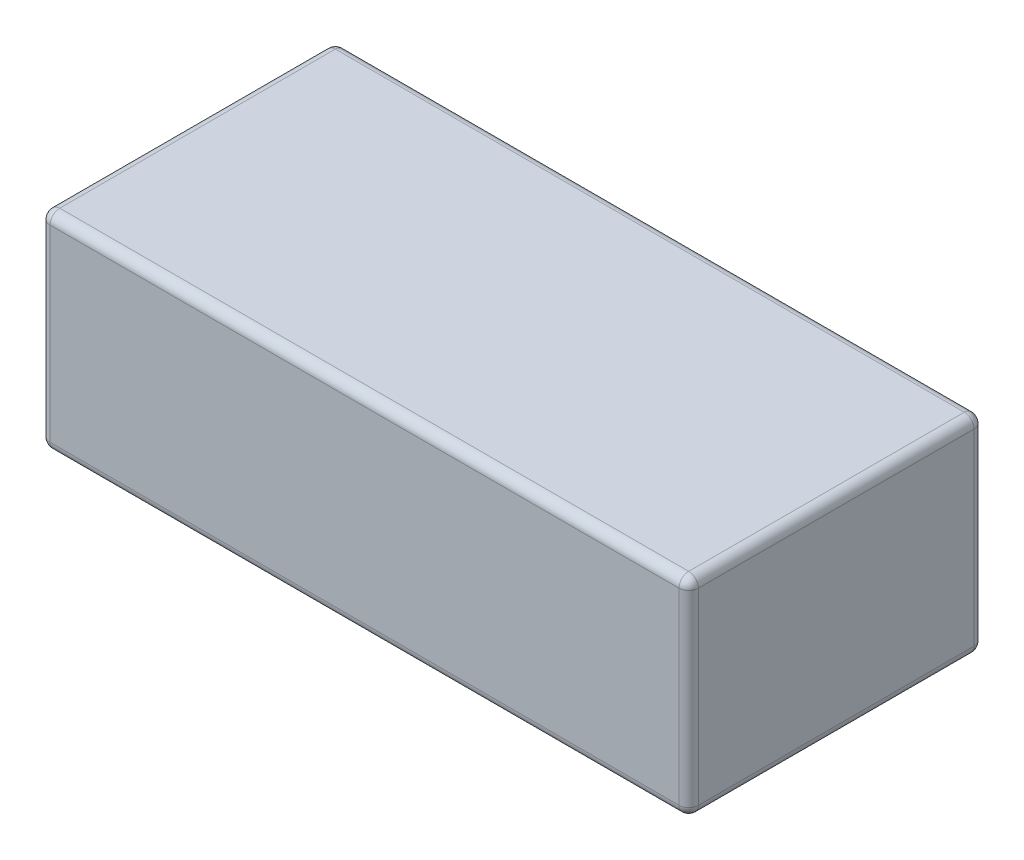
ISO-10303-21;
HEADER;
FILE_DESCRIPTION(('STEP AP214'),'2;1');
FILE_NAME('part.step','',(''),(''),'','','');
FILE_SCHEMA(('AUTOMOTIVE_DESIGN { 1 0 10303 214 1 1 1 1 }'));
ENDSEC;
DATA;
#1=APPLICATION_CONTEXT('core data for automotive mechanical design processes');
#2=APPLICATION_PROTOCOL_DEFINITION('international standard','automotive_design',2000,#1);
#3=PRODUCT_CONTEXT('',#1,'mechanical');
#4=PRODUCT('Part','Part','',(#3));
#5=PRODUCT_RELATED_PRODUCT_CATEGORY('part','',(#4));
#6=PRODUCT_DEFINITION_FORMATION('','',#4);
#7=PRODUCT_DEFINITION_CONTEXT('part definition',#1,'design');
#8=PRODUCT_DEFINITION('design','',#6,#7);
#9=PRODUCT_DEFINITION_SHAPE('','',#8);
#10=(LENGTH_UNIT() NAMED_UNIT(*) SI_UNIT(.MILLI.,.METRE.));
#11=(NAMED_UNIT(*) PLANE_ANGLE_UNIT() SI_UNIT($,.RADIAN.));
#12=(NAMED_UNIT(*) SI_UNIT($,.STERADIAN.) SOLID_ANGLE_UNIT());
#13=UNCERTAINTY_MEASURE_WITH_UNIT(LENGTH_MEASURE(1.E-05),#10,'distance_accuracy_value','');
#14=(GEOMETRIC_REPRESENTATION_CONTEXT(3) GLOBAL_UNCERTAINTY_ASSIGNED_CONTEXT((#13)) GLOBAL_UNIT_ASSIGNED_CONTEXT((#10,
#11,#12)) REPRESENTATION_CONTEXT('',''));
#15=CARTESIAN_POINT('',(0.,0.,0.));
#16=DIRECTION('',(0.,0.,1.));
#17=DIRECTION('',(1.,0.,0.));
#18=AXIS2_PLACEMENT_3D('',#15,#16,#17);
#19=CARTESIAN_POINT('',(100.,64.,45.5));
#20=DIRECTION('',(-1.,0.,0.));
#21=DIRECTION('',(0.,0.,1.));
#22=AXIS2_PLACEMENT_3D('',#19,#20,#21);
#23=PLANE('',#22);
#24=DIRECTION('',(0.,-1.,0.));
#25=VECTOR('',#24,1.);
#26=CARTESIAN_POINT('',(100.,64.,42.5));
#27=LINE('',#26,#25);
#28=CARTESIAN_POINT('',(100.,61.,42.5));
#29=VERTEX_POINT('',#28);
#30=CARTESIAN_POINT('',(100.,3.,42.5));
#31=VERTEX_POINT('',#30);
#32=EDGE_CURVE('E219',#29,#31,#27,.T.);
#33=ORIENTED_EDGE('',*,*,#32,.T.);
#34=DIRECTION('',(0.,0.,-1.));
#35=VECTOR('',#34,1.);
#36=CARTESIAN_POINT('',(100.,3.,-45.5));
#37=LINE('',#36,#35);
#38=CARTESIAN_POINT('',(100.,3.,-42.5));
#39=VERTEX_POINT('',#38);
#40=EDGE_CURVE('E226',#31,#39,#37,.T.);
#41=ORIENTED_EDGE('',*,*,#40,.T.);
#42=DIRECTION('',(0.,-1.,0.));
#43=VECTOR('',#42,1.);
#44=CARTESIAN_POINT('',(100.,64.,-42.5));
#45=LINE('',#44,#43);
#46=CARTESIAN_POINT('',(100.,61.,-42.5));
#47=VERTEX_POINT('',#46);
#48=EDGE_CURVE('E223',#39,#47,#45,.F.);
#49=ORIENTED_EDGE('',*,*,#48,.T.);
#50=DIRECTION('',(0.,0.,-1.));
#51=VECTOR('',#50,1.);
#52=CARTESIAN_POINT('',(100.,61.,45.5));
#53=LINE('',#52,#51);
#54=EDGE_CURVE('E224',#47,#29,#53,.F.);
#55=ORIENTED_EDGE('',*,*,#54,.T.);
#56=EDGE_LOOP('',(#33,#41,#49,#55));
#57=FACE_BOUND('',#56,.T.);
#58=ADVANCED_FACE('F37',(#57),#23,.F.);
#59=CARTESIAN_POINT('',(-100.,64.,-45.5));
#60=DIRECTION('',(0.,0.,1.));
#61=DIRECTION('',(1.,0.,0.));
#62=AXIS2_PLACEMENT_3D('',#59,#60,#61);
#63=PLANE('',#62);
#64=DIRECTION('',(0.,-1.,0.));
#65=VECTOR('',#64,1.);
#66=CARTESIAN_POINT('',(97.,64.,-45.5));
#67=LINE('',#66,#65);
#68=CARTESIAN_POINT('',(97.,61.,-45.5));
#69=VERTEX_POINT('',#68);
#70=CARTESIAN_POINT('',(97.,3.,-45.5));
#71=VERTEX_POINT('',#70);
#72=EDGE_CURVE('E136',#69,#71,#67,.T.);
#73=ORIENTED_EDGE('',*,*,#72,.T.);
#74=DIRECTION('',(-1.,0.,0.));
#75=VECTOR('',#74,1.);
#76=CARTESIAN_POINT('',(-100.,3.,-45.5));
#77=LINE('',#76,#75);
#78=CARTESIAN_POINT('',(-97.,3.,-45.5));
#79=VERTEX_POINT('',#78);
#80=EDGE_CURVE('E132',#71,#79,#77,.T.);
#81=ORIENTED_EDGE('',*,*,#80,.T.);
#82=DIRECTION('',(0.,-1.,0.));
#83=VECTOR('',#82,1.);
#84=CARTESIAN_POINT('',(-97.,64.,-45.5));
#85=LINE('',#84,#83);
#86=CARTESIAN_POINT('',(-97.,61.,-45.5));
#87=VERTEX_POINT('',#86);
#88=EDGE_CURVE('E126',#79,#87,#85,.F.);
#89=ORIENTED_EDGE('',*,*,#88,.T.);
#90=DIRECTION('',(-1.,0.,0.));
#91=VECTOR('',#90,1.);
#92=CARTESIAN_POINT('',(-100.,61.,-45.5));
#93=LINE('',#92,#91);
#94=EDGE_CURVE('E129',#87,#69,#93,.F.);
#95=ORIENTED_EDGE('',*,*,#94,.T.);
#96=EDGE_LOOP('',(#73,#81,#89,#95));
#97=FACE_BOUND('',#96,.T.);
#98=ADVANCED_FACE('F128',(#97),#63,.F.);
#99=CARTESIAN_POINT('',(-100.,64.,45.5));
#100=DIRECTION('',(1.,0.,0.));
#101=DIRECTION('',(0.,0.,-1.));
#102=AXIS2_PLACEMENT_3D('',#99,#100,#101);
#103=PLANE('',#102);
#104=DIRECTION('',(0.,0.,1.));
#105=VECTOR('',#104,1.);
#106=CARTESIAN_POINT('',(-100.,61.,45.5));
#107=LINE('',#106,#105);
#108=CARTESIAN_POINT('',(-100.,61.,42.5));
#109=VERTEX_POINT('',#108);
#110=CARTESIAN_POINT('',(-100.,61.,-42.5));
#111=VERTEX_POINT('',#110);
#112=EDGE_CURVE('E233',#109,#111,#107,.F.);
#113=ORIENTED_EDGE('',*,*,#112,.T.);
#114=DIRECTION('',(0.,-1.,0.));
#115=VECTOR('',#114,1.);
#116=CARTESIAN_POINT('',(-100.,64.,-42.5));
#117=LINE('',#116,#115);
#118=CARTESIAN_POINT('',(-100.,3.,-42.5));
#119=VERTEX_POINT('',#118);
#120=EDGE_CURVE('E158',#111,#119,#117,.T.);
#121=ORIENTED_EDGE('',*,*,#120,.T.);
#122=DIRECTION('',(0.,0.,1.));
#123=VECTOR('',#122,1.);
#124=CARTESIAN_POINT('',(-100.,3.,45.5));
#125=LINE('',#124,#123);
#126=CARTESIAN_POINT('',(-100.,3.,42.5));
#127=VERTEX_POINT('',#126);
#128=EDGE_CURVE('E237',#119,#127,#125,.T.);
#129=ORIENTED_EDGE('',*,*,#128,.T.);
#130=DIRECTION('',(0.,-1.,0.));
#131=VECTOR('',#130,1.);
#132=CARTESIAN_POINT('',(-100.,64.,42.5));
#133=LINE('',#132,#131);
#134=EDGE_CURVE('E235',#127,#109,#133,.F.);
#135=ORIENTED_EDGE('',*,*,#134,.T.);
#136=EDGE_LOOP('',(#113,#121,#129,#135));
#137=FACE_BOUND('',#136,.T.);
#138=ADVANCED_FACE('F298',(#137),#103,.F.);
#139=CARTESIAN_POINT('',(-100.,64.,45.5));
#140=DIRECTION('',(0.,0.,-1.));
#141=DIRECTION('',(-1.,0.,0.));
#142=AXIS2_PLACEMENT_3D('',#139,#140,#141);
#143=PLANE('',#142);
#144=DIRECTION('',(0.,-1.,0.));
#145=VECTOR('',#144,1.);
#146=CARTESIAN_POINT('',(-97.,64.,45.5));
#147=LINE('',#146,#145);
#148=CARTESIAN_POINT('',(-97.,61.,45.5));
#149=VERTEX_POINT('',#148);
#150=CARTESIAN_POINT('',(-97.,3.,45.5));
#151=VERTEX_POINT('',#150);
#152=EDGE_CURVE('E242',#149,#151,#147,.T.);
#153=ORIENTED_EDGE('',*,*,#152,.T.);
#154=DIRECTION('',(1.,0.,0.));
#155=VECTOR('',#154,1.);
#156=CARTESIAN_POINT('',(100.,3.,45.5));
#157=LINE('',#156,#155);
#158=CARTESIAN_POINT('',(97.,3.,45.5));
#159=VERTEX_POINT('',#158);
#160=EDGE_CURVE('E245',#151,#159,#157,.T.);
#161=ORIENTED_EDGE('',*,*,#160,.T.);
#162=DIRECTION('',(0.,-1.,0.));
#163=VECTOR('',#162,1.);
#164=CARTESIAN_POINT('',(97.,64.,45.5));
#165=LINE('',#164,#163);
#166=CARTESIAN_POINT('',(97.,61.,45.5));
#167=VERTEX_POINT('',#166);
#168=EDGE_CURVE('E217',#159,#167,#165,.F.);
#169=ORIENTED_EDGE('',*,*,#168,.T.);
#170=DIRECTION('',(1.,0.,0.));
#171=VECTOR('',#170,1.);
#172=CARTESIAN_POINT('',(-100.,61.,45.5));
#173=LINE('',#172,#171);
#174=EDGE_CURVE('E240',#167,#149,#173,.F.);
#175=ORIENTED_EDGE('',*,*,#174,.T.);
#176=EDGE_LOOP('',(#153,#161,#169,#175));
#177=FACE_BOUND('',#176,.T.);
#178=ADVANCED_FACE('F369',(#177),#143,.F.);
#179=CARTESIAN_POINT('',(0.,64.,0.));
#180=DIRECTION('',(0.,-1.,0.));
#181=DIRECTION('',(0.,0.,-1.));
#182=AXIS2_PLACEMENT_3D('',#179,#180,#181);
#183=PLANE('',#182);
#184=DIRECTION('',(0.,0.,-1.));
#185=VECTOR('',#184,1.);
#186=CARTESIAN_POINT('',(97.,64.,0.));
#187=LINE('',#186,#185);
#188=CARTESIAN_POINT('',(97.,64.,42.5));
#189=VERTEX_POINT('',#188);
#190=CARTESIAN_POINT('',(97.,64.,-42.5));
#191=VERTEX_POINT('',#190);
#192=EDGE_CURVE('E46',#189,#191,#187,.T.);
#193=ORIENTED_EDGE('',*,*,#192,.T.);
#194=DIRECTION('',(-1.,0.,0.));
#195=VECTOR('',#194,1.);
#196=CARTESIAN_POINT('',(0.,64.,-42.5));
#197=LINE('',#196,#195);
#198=CARTESIAN_POINT('',(-97.,64.,-42.5));
#199=VERTEX_POINT('',#198);
#200=EDGE_CURVE('E11',#191,#199,#197,.T.);
#201=ORIENTED_EDGE('',*,*,#200,.T.);
#202=DIRECTION('',(0.,0.,1.));
#203=VECTOR('',#202,1.);
#204=CARTESIAN_POINT('',(-97.,64.,0.));
#205=LINE('',#204,#203);
#206=CARTESIAN_POINT('',(-97.,64.,42.5));
#207=VERTEX_POINT('',#206);
#208=EDGE_CURVE('E247',#199,#207,#205,.T.);
#209=ORIENTED_EDGE('',*,*,#208,.T.);
#210=DIRECTION('',(1.,0.,0.));
#211=VECTOR('',#210,1.);
#212=CARTESIAN_POINT('',(0.,64.,42.5));
#213=LINE('',#212,#211);
#214=EDGE_CURVE('E57',#207,#189,#213,.T.);
#215=ORIENTED_EDGE('',*,*,#214,.T.);
#216=EDGE_LOOP('',(#193,#201,#209,#215));
#217=FACE_BOUND('',#216,.T.);
#218=ADVANCED_FACE('F364',(#217),#183,.F.);
#219=CARTESIAN_POINT('',(0.,0.,0.));
#220=DIRECTION('',(0.,-1.,0.));
#221=DIRECTION('',(0.,0.,-1.));
#222=AXIS2_PLACEMENT_3D('',#219,#220,#221);
#223=PLANE('',#222);
#224=DIRECTION('',(0.,0.,1.));
#225=VECTOR('',#224,1.);
#226=CARTESIAN_POINT('',(-97.,0.,-45.5));
#227=LINE('',#226,#225);
#228=CARTESIAN_POINT('',(-97.,0.,42.5));
#229=VERTEX_POINT('',#228);
#230=CARTESIAN_POINT('',(-97.,0.,-42.5));
#231=VERTEX_POINT('',#230);
#232=EDGE_CURVE('E276',#229,#231,#227,.F.);
#233=ORIENTED_EDGE('',*,*,#232,.T.);
#234=DIRECTION('',(-1.,0.,0.));
#235=VECTOR('',#234,1.);
#236=CARTESIAN_POINT('',(100.,0.,-42.5));
#237=LINE('',#236,#235);
#238=CARTESIAN_POINT('',(97.,0.,-42.5));
#239=VERTEX_POINT('',#238);
#240=EDGE_CURVE('E228',#231,#239,#237,.F.);
#241=ORIENTED_EDGE('',*,*,#240,.T.);
#242=DIRECTION('',(0.,0.,-1.));
#243=VECTOR('',#242,1.);
#244=CARTESIAN_POINT('',(97.,0.,45.5));
#245=LINE('',#244,#243);
#246=CARTESIAN_POINT('',(97.,0.,42.5));
#247=VERTEX_POINT('',#246);
#248=EDGE_CURVE('E271',#239,#247,#245,.F.);
#249=ORIENTED_EDGE('',*,*,#248,.T.);
#250=DIRECTION('',(1.,0.,0.));
#251=VECTOR('',#250,1.);
#252=CARTESIAN_POINT('',(-100.,0.,42.5));
#253=LINE('',#252,#251);
#254=EDGE_CURVE('E286',#247,#229,#253,.F.);
#255=ORIENTED_EDGE('',*,*,#254,.T.);
#256=EDGE_LOOP('',(#233,#241,#249,#255));
#257=FACE_BOUND('',#256,.T.);
#258=ADVANCED_FACE('F279',(#257),#223,.T.);
#259=CARTESIAN_POINT('',(0.,61.,42.5));
#260=DIRECTION('',(1.,0.,0.));
#261=DIRECTION('',(0.,0.,-1.));
#262=AXIS2_PLACEMENT_3D('',#259,#260,#261);
#263=CYLINDRICAL_SURFACE('',#262,3.);
#264=CARTESIAN_POINT('',(97.,61.,42.5));
#265=DIRECTION('',(1.,0.,0.));
#266=DIRECTION('',(0.,0.,-1.));
#267=AXIS2_PLACEMENT_3D('',#264,#265,#266);
#268=CIRCLE('',#267,3.);
#269=EDGE_CURVE('E41',#189,#167,#268,.T.);
#270=ORIENTED_EDGE('',*,*,#269,.F.);
#271=ORIENTED_EDGE('',*,*,#214,.F.);
#272=CARTESIAN_POINT('',(-97.,61.,42.5));
#273=DIRECTION('',(-1.,0.,0.));
#274=DIRECTION('',(0.,0.,1.));
#275=AXIS2_PLACEMENT_3D('',#272,#273,#274);
#276=CIRCLE('',#275,3.);
#277=EDGE_CURVE('E199',#149,#207,#276,.T.);
#278=ORIENTED_EDGE('',*,*,#277,.F.);
#279=ORIENTED_EDGE('',*,*,#174,.F.);
#280=EDGE_LOOP('',(#270,#271,#278,#279));
#281=FACE_BOUND('',#280,.T.);
#282=ADVANCED_FACE('F39',(#281),#263,.T.);
#283=CARTESIAN_POINT('',(97.,61.,42.5));
#284=DIRECTION('',(0.,0.,1.));
#285=DIRECTION('',(1.,0.,0.));
#286=AXIS2_PLACEMENT_3D('',#283,#284,#285);
#287=SPHERICAL_SURFACE('',#286,3.);
#288=CARTESIAN_POINT('',(97.,61.,42.5));
#289=DIRECTION('',(0.,0.,1.));
#290=DIRECTION('',(1.,0.,0.));
#291=AXIS2_PLACEMENT_3D('',#288,#289,#290);
#292=CIRCLE('',#291,3.);
#293=EDGE_CURVE('E194',#189,#29,#292,.F.);
#294=ORIENTED_EDGE('',*,*,#293,.F.);
#295=ORIENTED_EDGE('',*,*,#269,.T.);
#296=CARTESIAN_POINT('',(97.,61.,42.5));
#297=DIRECTION('',(0.,1.,0.));
#298=DIRECTION('',(0.,0.,1.));
#299=AXIS2_PLACEMENT_3D('',#296,#297,#298);
#300=CIRCLE('',#299,3.);
#301=EDGE_CURVE('E197',#29,#167,#300,.F.);
#302=ORIENTED_EDGE('',*,*,#301,.F.);
#303=EDGE_LOOP('',(#294,#295,#302));
#304=FACE_BOUND('',#303,.T.);
#305=ADVANCED_FACE('F209',(#304),#287,.T.);
#306=CARTESIAN_POINT('',(-97.,61.,42.5));
#307=DIRECTION('',(0.,0.,1.));
#308=DIRECTION('',(1.,0.,0.));
#309=AXIS2_PLACEMENT_3D('',#306,#307,#308);
#310=SPHERICAL_SURFACE('',#309,3.);
#311=CARTESIAN_POINT('',(-97.,61.,42.5));
#312=DIRECTION('',(0.,1.,0.));
#313=DIRECTION('',(0.,0.,1.));
#314=AXIS2_PLACEMENT_3D('',#311,#312,#313);
#315=CIRCLE('',#314,3.);
#316=EDGE_CURVE('E188',#149,#109,#315,.F.);
#317=ORIENTED_EDGE('',*,*,#316,.F.);
#318=ORIENTED_EDGE('',*,*,#277,.T.);
#319=CARTESIAN_POINT('',(-97.,61.,42.5));
#320=DIRECTION('',(0.,0.,1.));
#321=DIRECTION('',(1.,0.,0.));
#322=AXIS2_PLACEMENT_3D('',#319,#320,#321);
#323=CIRCLE('',#322,3.);
#324=EDGE_CURVE('E191',#109,#207,#323,.F.);
#325=ORIENTED_EDGE('',*,*,#324,.F.);
#326=EDGE_LOOP('',(#317,#318,#325));
#327=FACE_BOUND('',#326,.T.);
#328=ADVANCED_FACE('F355',(#327),#310,.T.);
#329=CARTESIAN_POINT('',(97.,64.,42.5));
#330=DIRECTION('',(0.,-1.,0.));
#331=DIRECTION('',(0.,0.,-1.));
#332=AXIS2_PLACEMENT_3D('',#329,#330,#331);
#333=CYLINDRICAL_SURFACE('',#332,3.);
#334=ORIENTED_EDGE('',*,*,#301,.T.);
#335=ORIENTED_EDGE('',*,*,#168,.F.);
#336=CARTESIAN_POINT('',(97.,3.,42.5));
#337=DIRECTION('',(0.,-1.,0.));
#338=DIRECTION('',(0.,0.,-1.));
#339=AXIS2_PLACEMENT_3D('',#336,#337,#338);
#340=CIRCLE('',#339,3.);
#341=EDGE_CURVE('E183',#31,#159,#340,.T.);
#342=ORIENTED_EDGE('',*,*,#341,.F.);
#343=ORIENTED_EDGE('',*,*,#32,.F.);
#344=EDGE_LOOP('',(#334,#335,#342,#343));
#345=FACE_BOUND('',#344,.T.);
#346=ADVANCED_FACE('F215',(#345),#333,.T.);
#347=CARTESIAN_POINT('',(97.,61.,0.));
#348=DIRECTION('',(0.,0.,-1.));
#349=DIRECTION('',(-1.,0.,0.));
#350=AXIS2_PLACEMENT_3D('',#347,#348,#349);
#351=CYLINDRICAL_SURFACE('',#350,3.);
#352=ORIENTED_EDGE('',*,*,#293,.T.);
#353=ORIENTED_EDGE('',*,*,#54,.F.);
#354=CARTESIAN_POINT('',(97.,61.,-42.5));
#355=DIRECTION('',(0.,0.,-1.));
#356=DIRECTION('',(-1.,0.,0.));
#357=AXIS2_PLACEMENT_3D('',#354,#355,#356);
#358=CIRCLE('',#357,3.);
#359=EDGE_CURVE('E180',#191,#47,#358,.T.);
#360=ORIENTED_EDGE('',*,*,#359,.F.);
#361=ORIENTED_EDGE('',*,*,#192,.F.);
#362=EDGE_LOOP('',(#352,#353,#360,#361));
#363=FACE_BOUND('',#362,.T.);
#364=ADVANCED_FACE('F349',(#363),#351,.T.);
#365=CARTESIAN_POINT('',(0.,61.,-42.5));
#366=DIRECTION('',(-1.,0.,0.));
#367=DIRECTION('',(0.,0.,1.));
#368=AXIS2_PLACEMENT_3D('',#365,#366,#367);
#369=CYLINDRICAL_SURFACE('',#368,3.);
#370=CARTESIAN_POINT('',(-97.,61.,-42.5));
#371=DIRECTION('',(-1.,0.,0.));
#372=DIRECTION('',(0.,0.,1.));
#373=AXIS2_PLACEMENT_3D('',#370,#371,#372);
#374=CIRCLE('',#373,3.);
#375=EDGE_CURVE('E142',#199,#87,#374,.T.);
#376=ORIENTED_EDGE('',*,*,#375,.F.);
#377=ORIENTED_EDGE('',*,*,#200,.F.);
#378=CARTESIAN_POINT('',(97.,61.,-42.5));
#379=DIRECTION('',(1.,0.,0.));
#380=DIRECTION('',(0.,0.,-1.));
#381=AXIS2_PLACEMENT_3D('',#378,#379,#380);
#382=CIRCLE('',#381,3.);
#383=EDGE_CURVE('E145',#69,#191,#382,.T.);
#384=ORIENTED_EDGE('',*,*,#383,.F.);
#385=ORIENTED_EDGE('',*,*,#94,.F.);
#386=EDGE_LOOP('',(#376,#377,#384,#385));
#387=FACE_BOUND('',#386,.T.);
#388=ADVANCED_FACE('F141',(#387),#369,.T.);
#389=CARTESIAN_POINT('',(-97.,61.,0.));
#390=DIRECTION('',(0.,0.,1.));
#391=DIRECTION('',(1.,0.,0.));
#392=AXIS2_PLACEMENT_3D('',#389,#390,#391);
#393=CYLINDRICAL_SURFACE('',#392,3.);
#394=ORIENTED_EDGE('',*,*,#324,.T.);
#395=ORIENTED_EDGE('',*,*,#208,.F.);
#396=CARTESIAN_POINT('',(-97.,61.,-42.5));
#397=DIRECTION('',(0.,0.,-1.));
#398=DIRECTION('',(-1.,0.,0.));
#399=AXIS2_PLACEMENT_3D('',#396,#397,#398);
#400=CIRCLE('',#399,3.);
#401=EDGE_CURVE('E154',#111,#199,#400,.T.);
#402=ORIENTED_EDGE('',*,*,#401,.F.);
#403=ORIENTED_EDGE('',*,*,#112,.F.);
#404=EDGE_LOOP('',(#394,#395,#402,#403));
#405=FACE_BOUND('',#404,.T.);
#406=ADVANCED_FACE('F342',(#405),#393,.T.);
#407=CARTESIAN_POINT('',(-97.,64.,42.5));
#408=DIRECTION('',(0.,-1.,0.));
#409=DIRECTION('',(0.,0.,-1.));
#410=AXIS2_PLACEMENT_3D('',#407,#408,#409);
#411=CYLINDRICAL_SURFACE('',#410,3.);
#412=ORIENTED_EDGE('',*,*,#316,.T.);
#413=ORIENTED_EDGE('',*,*,#134,.F.);
#414=CARTESIAN_POINT('',(-97.,3.,42.5));
#415=DIRECTION('',(0.,-1.,0.));
#416=DIRECTION('',(0.,0.,-1.));
#417=AXIS2_PLACEMENT_3D('',#414,#415,#416);
#418=CIRCLE('',#417,3.);
#419=EDGE_CURVE('E175',#151,#127,#418,.T.);
#420=ORIENTED_EDGE('',*,*,#419,.F.);
#421=ORIENTED_EDGE('',*,*,#152,.F.);
#422=EDGE_LOOP('',(#412,#413,#420,#421));
#423=FACE_BOUND('',#422,.T.);
#424=ADVANCED_FACE('F338',(#423),#411,.T.);
#425=CARTESIAN_POINT('',(-100.,3.,42.5));
#426=DIRECTION('',(-1.,0.,0.));
#427=DIRECTION('',(0.,0.,1.));
#428=AXIS2_PLACEMENT_3D('',#425,#426,#427);
#429=CYLINDRICAL_SURFACE('',#428,3.);
#430=CARTESIAN_POINT('',(97.,3.,42.5));
#431=DIRECTION('',(1.,0.,0.));
#432=DIRECTION('',(0.,0.,-1.));
#433=AXIS2_PLACEMENT_3D('',#430,#431,#432);
#434=CIRCLE('',#433,3.);
#435=EDGE_CURVE('E185',#159,#247,#434,.T.);
#436=ORIENTED_EDGE('',*,*,#435,.F.);
#437=ORIENTED_EDGE('',*,*,#160,.F.);
#438=CARTESIAN_POINT('',(-97.,3.,42.5));
#439=DIRECTION('',(-1.,0.,0.));
#440=DIRECTION('',(0.,0.,1.));
#441=AXIS2_PLACEMENT_3D('',#438,#439,#440);
#442=CIRCLE('',#441,3.);
#443=EDGE_CURVE('E172',#229,#151,#442,.T.);
#444=ORIENTED_EDGE('',*,*,#443,.F.);
#445=ORIENTED_EDGE('',*,*,#254,.F.);
#446=EDGE_LOOP('',(#436,#437,#444,#445));
#447=FACE_BOUND('',#446,.T.);
#448=ADVANCED_FACE('F334',(#447),#429,.T.);
#449=CARTESIAN_POINT('',(97.,3.,42.5));
#450=DIRECTION('',(0.,0.,1.));
#451=DIRECTION('',(1.,0.,0.));
#452=AXIS2_PLACEMENT_3D('',#449,#450,#451);
#453=SPHERICAL_SURFACE('',#452,3.);
#454=ORIENTED_EDGE('',*,*,#341,.T.);
#455=ORIENTED_EDGE('',*,*,#435,.T.);
#456=CARTESIAN_POINT('',(97.,3.,42.5));
#457=DIRECTION('',(0.,0.,1.));
#458=DIRECTION('',(1.,0.,0.));
#459=AXIS2_PLACEMENT_3D('',#456,#457,#458);
#460=CIRCLE('',#459,3.);
#461=EDGE_CURVE('E163',#31,#247,#460,.F.);
#462=ORIENTED_EDGE('',*,*,#461,.F.);
#463=EDGE_LOOP('',(#454,#455,#462));
#464=FACE_BOUND('',#463,.T.);
#465=ADVANCED_FACE('F330',(#464),#453,.T.);
#466=CARTESIAN_POINT('',(97.,61.,-42.5));
#467=DIRECTION('',(0.,0.,1.));
#468=DIRECTION('',(1.,0.,0.));
#469=AXIS2_PLACEMENT_3D('',#466,#467,#468);
#470=SPHERICAL_SURFACE('',#469,3.);
#471=ORIENTED_EDGE('',*,*,#383,.T.);
#472=ORIENTED_EDGE('',*,*,#359,.T.);
#473=CARTESIAN_POINT('',(97.,61.,-42.5));
#474=DIRECTION('',(0.,1.,0.));
#475=DIRECTION('',(0.,0.,1.));
#476=AXIS2_PLACEMENT_3D('',#473,#474,#475);
#477=CIRCLE('',#476,3.);
#478=EDGE_CURVE('E159',#69,#47,#477,.F.);
#479=ORIENTED_EDGE('',*,*,#478,.F.);
#480=EDGE_LOOP('',(#471,#472,#479));
#481=FACE_BOUND('',#480,.T.);
#482=ADVANCED_FACE('F327',(#481),#470,.T.);
#483=CARTESIAN_POINT('',(-97.,61.,-42.5));
#484=DIRECTION('',(0.,0.,1.));
#485=DIRECTION('',(1.,0.,0.));
#486=AXIS2_PLACEMENT_3D('',#483,#484,#485);
#487=SPHERICAL_SURFACE('',#486,3.);
#488=ORIENTED_EDGE('',*,*,#401,.T.);
#489=ORIENTED_EDGE('',*,*,#375,.T.);
#490=CARTESIAN_POINT('',(-97.,61.,-42.5));
#491=DIRECTION('',(0.,1.,0.));
#492=DIRECTION('',(0.,0.,1.));
#493=AXIS2_PLACEMENT_3D('',#490,#491,#492);
#494=CIRCLE('',#493,3.);
#495=EDGE_CURVE('E151',#111,#87,#494,.F.);
#496=ORIENTED_EDGE('',*,*,#495,.F.);
#497=EDGE_LOOP('',(#488,#489,#496));
#498=FACE_BOUND('',#497,.T.);
#499=ADVANCED_FACE('F150',(#498),#487,.T.);
#500=CARTESIAN_POINT('',(-97.,3.,42.5));
#501=DIRECTION('',(0.,0.,1.));
#502=DIRECTION('',(1.,0.,0.));
#503=AXIS2_PLACEMENT_3D('',#500,#501,#502);
#504=SPHERICAL_SURFACE('',#503,3.);
#505=ORIENTED_EDGE('',*,*,#443,.T.);
#506=ORIENTED_EDGE('',*,*,#419,.T.);
#507=CARTESIAN_POINT('',(-97.,3.,42.5));
#508=DIRECTION('',(0.,0.,1.));
#509=DIRECTION('',(1.,0.,0.));
#510=AXIS2_PLACEMENT_3D('',#507,#508,#509);
#511=CIRCLE('',#510,3.);
#512=EDGE_CURVE('E160',#229,#127,#511,.F.);
#513=ORIENTED_EDGE('',*,*,#512,.F.);
#514=EDGE_LOOP('',(#505,#506,#513));
#515=FACE_BOUND('',#514,.T.);
#516=ADVANCED_FACE('F321',(#515),#504,.T.);
#517=CARTESIAN_POINT('',(97.,3.,45.5));
#518=DIRECTION('',(0.,0.,1.));
#519=DIRECTION('',(1.,0.,0.));
#520=AXIS2_PLACEMENT_3D('',#517,#518,#519);
#521=CYLINDRICAL_SURFACE('',#520,3.);
#522=ORIENTED_EDGE('',*,*,#461,.T.);
#523=ORIENTED_EDGE('',*,*,#248,.F.);
#524=CARTESIAN_POINT('',(97.,3.,-42.5));
#525=DIRECTION('',(0.,0.,-1.));
#526=DIRECTION('',(-1.,0.,0.));
#527=AXIS2_PLACEMENT_3D('',#524,#525,#526);
#528=CIRCLE('',#527,3.);
#529=EDGE_CURVE('E166',#39,#239,#528,.T.);
#530=ORIENTED_EDGE('',*,*,#529,.F.);
#531=ORIENTED_EDGE('',*,*,#40,.F.);
#532=EDGE_LOOP('',(#522,#523,#530,#531));
#533=FACE_BOUND('',#532,.T.);
#534=ADVANCED_FACE('F273',(#533),#521,.T.);
#535=CARTESIAN_POINT('',(97.,64.,-42.5));
#536=DIRECTION('',(0.,-1.,0.));
#537=DIRECTION('',(0.,0.,-1.));
#538=AXIS2_PLACEMENT_3D('',#535,#536,#537);
#539=CYLINDRICAL_SURFACE('',#538,3.);
#540=ORIENTED_EDGE('',*,*,#478,.T.);
#541=ORIENTED_EDGE('',*,*,#48,.F.);
#542=CARTESIAN_POINT('',(97.,3.,-42.5));
#543=DIRECTION('',(0.,-1.,0.));
#544=DIRECTION('',(0.,0.,-1.));
#545=AXIS2_PLACEMENT_3D('',#542,#543,#544);
#546=CIRCLE('',#545,3.);
#547=EDGE_CURVE('E260',#71,#39,#546,.T.);
#548=ORIENTED_EDGE('',*,*,#547,.F.);
#549=ORIENTED_EDGE('',*,*,#72,.F.);
#550=EDGE_LOOP('',(#540,#541,#548,#549));
#551=FACE_BOUND('',#550,.T.);
#552=ADVANCED_FACE('F291',(#551),#539,.T.);
#553=CARTESIAN_POINT('',(-97.,64.,-42.5));
#554=DIRECTION('',(0.,-1.,0.));
#555=DIRECTION('',(0.,0.,-1.));
#556=AXIS2_PLACEMENT_3D('',#553,#554,#555);
#557=CYLINDRICAL_SURFACE('',#556,3.);
#558=ORIENTED_EDGE('',*,*,#495,.T.);
#559=ORIENTED_EDGE('',*,*,#88,.F.);
#560=CARTESIAN_POINT('',(-97.,3.,-42.5));
#561=DIRECTION('',(0.,-1.,0.));
#562=DIRECTION('',(0.,0.,-1.));
#563=AXIS2_PLACEMENT_3D('',#560,#561,#562);
#564=CIRCLE('',#563,3.);
#565=EDGE_CURVE('E257',#119,#79,#564,.T.);
#566=ORIENTED_EDGE('',*,*,#565,.F.);
#567=ORIENTED_EDGE('',*,*,#120,.F.);
#568=EDGE_LOOP('',(#558,#559,#566,#567));
#569=FACE_BOUND('',#568,.T.);
#570=ADVANCED_FACE('F156',(#569),#557,.T.);
#571=CARTESIAN_POINT('',(-97.,3.,45.5));
#572=DIRECTION('',(0.,0.,-1.));
#573=DIRECTION('',(-1.,0.,0.));
#574=AXIS2_PLACEMENT_3D('',#571,#572,#573);
#575=CYLINDRICAL_SURFACE('',#574,3.);
#576=ORIENTED_EDGE('',*,*,#512,.T.);
#577=ORIENTED_EDGE('',*,*,#128,.F.);
#578=CARTESIAN_POINT('',(-97.,3.,-42.5));
#579=DIRECTION('',(0.,0.,-1.));
#580=DIRECTION('',(-1.,0.,0.));
#581=AXIS2_PLACEMENT_3D('',#578,#579,#580);
#582=CIRCLE('',#581,3.);
#583=EDGE_CURVE('E255',#231,#119,#582,.T.);
#584=ORIENTED_EDGE('',*,*,#583,.F.);
#585=ORIENTED_EDGE('',*,*,#232,.F.);
#586=EDGE_LOOP('',(#576,#577,#584,#585));
#587=FACE_BOUND('',#586,.T.);
#588=ADVANCED_FACE('F311',(#587),#575,.T.);
#589=CARTESIAN_POINT('',(97.,3.,-42.5));
#590=DIRECTION('',(0.,0.,1.));
#591=DIRECTION('',(1.,0.,0.));
#592=AXIS2_PLACEMENT_3D('',#589,#590,#591);
#593=SPHERICAL_SURFACE('',#592,3.);
#594=ORIENTED_EDGE('',*,*,#547,.T.);
#595=ORIENTED_EDGE('',*,*,#529,.T.);
#596=CARTESIAN_POINT('',(97.,3.,-42.5));
#597=DIRECTION('',(1.,0.,0.));
#598=DIRECTION('',(0.,0.,-1.));
#599=AXIS2_PLACEMENT_3D('',#596,#597,#598);
#600=CIRCLE('',#599,3.);
#601=EDGE_CURVE('E253',#71,#239,#600,.F.);
#602=ORIENTED_EDGE('',*,*,#601,.F.);
#603=EDGE_LOOP('',(#594,#595,#602));
#604=FACE_BOUND('',#603,.T.);
#605=ADVANCED_FACE('F266',(#604),#593,.T.);
#606=CARTESIAN_POINT('',(-97.,3.,-42.5));
#607=DIRECTION('',(0.,0.,1.));
#608=DIRECTION('',(1.,0.,0.));
#609=AXIS2_PLACEMENT_3D('',#606,#607,#608);
#610=SPHERICAL_SURFACE('',#609,3.);
#611=ORIENTED_EDGE('',*,*,#583,.T.);
#612=ORIENTED_EDGE('',*,*,#565,.T.);
#613=CARTESIAN_POINT('',(-97.,3.,-42.5));
#614=DIRECTION('',(-1.,0.,0.));
#615=DIRECTION('',(0.,0.,1.));
#616=AXIS2_PLACEMENT_3D('',#613,#614,#615);
#617=CIRCLE('',#616,3.);
#618=EDGE_CURVE('E251',#231,#79,#617,.F.);
#619=ORIENTED_EDGE('',*,*,#618,.F.);
#620=EDGE_LOOP('',(#611,#612,#619));
#621=FACE_BOUND('',#620,.T.);
#622=ADVANCED_FACE('F305',(#621),#610,.T.);
#623=CARTESIAN_POINT('',(-100.,3.,-42.5));
#624=DIRECTION('',(1.,0.,0.));
#625=DIRECTION('',(0.,0.,-1.));
#626=AXIS2_PLACEMENT_3D('',#623,#624,#625);
#627=CYLINDRICAL_SURFACE('',#626,3.);
#628=ORIENTED_EDGE('',*,*,#601,.T.);
#629=ORIENTED_EDGE('',*,*,#240,.F.);
#630=ORIENTED_EDGE('',*,*,#618,.T.);
#631=ORIENTED_EDGE('',*,*,#80,.F.);
#632=EDGE_LOOP('',(#628,#629,#630,#631));
#633=FACE_BOUND('',#632,.T.);
#634=ADVANCED_FACE('F302',(#633),#627,.T.);
#635=CLOSED_SHELL('',(#58,#98,#138,#178,#218,#258,#282,#305,#328,#346,#364,#388,#406,#424,#448,
#465,#482,#499,#516,#534,#552,#570,#588,#605,#622,#634));
#636=MANIFOLD_SOLID_BREP('B2',#635);
#637=ADVANCED_BREP_SHAPE_REPRESENTATION('',(#18,#636),#14);
#638=SHAPE_DEFINITION_REPRESENTATION(#9,#637);
ENDSEC;
END-ISO-10303-21;
